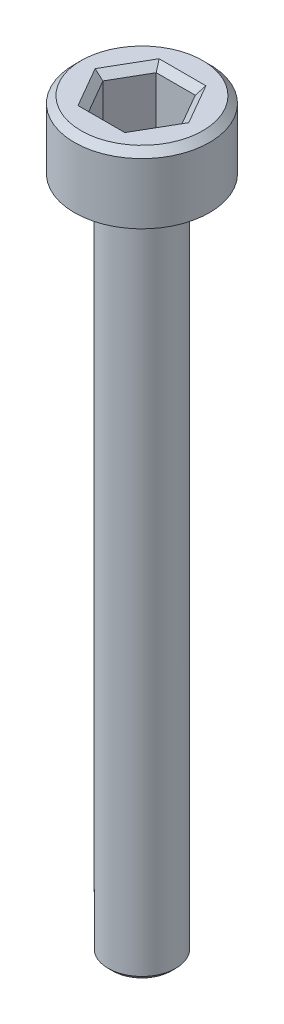
ISO-10303-21;
HEADER;
FILE_DESCRIPTION(('STEP AP214'),'2;1');
FILE_NAME('part.step','',(''),(''),'','','');
FILE_SCHEMA(('AUTOMOTIVE_DESIGN { 1 0 10303 214 1 1 1 1 }'));
ENDSEC;
DATA;
#1=APPLICATION_CONTEXT('core data for automotive mechanical design processes');
#2=APPLICATION_PROTOCOL_DEFINITION('international standard','automotive_design',2000,#1);
#3=PRODUCT_CONTEXT('',#1,'mechanical');
#4=PRODUCT('Part','Part','',(#3));
#5=PRODUCT_RELATED_PRODUCT_CATEGORY('part','',(#4));
#6=PRODUCT_DEFINITION_FORMATION('','',#4);
#7=PRODUCT_DEFINITION_CONTEXT('part definition',#1,'design');
#8=PRODUCT_DEFINITION('design','',#6,#7);
#9=PRODUCT_DEFINITION_SHAPE('','',#8);
#10=(LENGTH_UNIT() NAMED_UNIT(*) SI_UNIT(.MILLI.,.METRE.));
#11=(NAMED_UNIT(*) PLANE_ANGLE_UNIT() SI_UNIT($,.RADIAN.));
#12=(NAMED_UNIT(*) SI_UNIT($,.STERADIAN.) SOLID_ANGLE_UNIT());
#13=UNCERTAINTY_MEASURE_WITH_UNIT(LENGTH_MEASURE(1.E-05),#10,'distance_accuracy_value','');
#14=(GEOMETRIC_REPRESENTATION_CONTEXT(3) GLOBAL_UNCERTAINTY_ASSIGNED_CONTEXT((#13)) GLOBAL_UNIT_ASSIGNED_CONTEXT((#10,
#11,#12)) REPRESENTATION_CONTEXT('',''));
#15=CARTESIAN_POINT('',(0.,0.,0.));
#16=DIRECTION('',(0.,0.,1.));
#17=DIRECTION('',(1.,0.,0.));
#18=AXIS2_PLACEMENT_3D('',#15,#16,#17);
#19=CARTESIAN_POINT('',(0.,0.,0.));
#20=DIRECTION('',(0.,1.,0.));
#21=DIRECTION('',(0.,0.,1.));
#22=AXIS2_PLACEMENT_3D('',#19,#20,#21);
#23=PLANE('',#22);
#24=CARTESIAN_POINT('',(0.,0.,0.));
#25=DIRECTION('',(0.,1.,0.));
#26=DIRECTION('',(0.,0.,1.));
#27=AXIS2_PLACEMENT_3D('',#24,#25,#26);
#28=CIRCLE('',#27,3.);
#29=CARTESIAN_POINT('',(0.,0.,3.));
#30=VERTEX_POINT('',#29);
#31=EDGE_CURVE('E146',#30,#30,#28,.T.);
#32=ORIENTED_EDGE('',*,*,#31,.F.);
#33=EDGE_LOOP('',(#32));
#34=FACE_BOUND('',#33,.T.);
#35=CARTESIAN_POINT('',(0.,0.,0.));
#36=DIRECTION('',(0.,1.,0.));
#37=DIRECTION('',(0.,0.,1.));
#38=AXIS2_PLACEMENT_3D('',#35,#36,#37);
#39=CIRCLE('',#38,1.5);
#40=CARTESIAN_POINT('',(0.,0.,1.5));
#41=VERTEX_POINT('',#40);
#42=EDGE_CURVE('E185',#41,#41,#39,.F.);
#43=ORIENTED_EDGE('',*,*,#42,.F.);
#44=EDGE_LOOP('',(#43));
#45=FACE_BOUND('',#44,.T.);
#46=ADVANCED_FACE('F33',(#34,#45),#23,.F.);
#47=CARTESIAN_POINT('',(0.,3.,0.));
#48=DIRECTION('',(0.,-1.,0.));
#49=DIRECTION('',(0.,0.,-1.));
#50=AXIS2_PLACEMENT_3D('',#47,#48,#49);
#51=CYLINDRICAL_SURFACE('',#50,3.);
#52=CARTESIAN_POINT('',(0.,2.7,0.));
#53=DIRECTION('',(0.,1.,0.));
#54=DIRECTION('',(0.,0.,1.));
#55=AXIS2_PLACEMENT_3D('',#52,#53,#54);
#56=CIRCLE('',#55,3.);
#57=CARTESIAN_POINT('',(0.,2.7,3.));
#58=VERTEX_POINT('',#57);
#59=EDGE_CURVE('E160',#58,#58,#56,.F.);
#60=ORIENTED_EDGE('',*,*,#59,.T.);
#61=EDGE_LOOP('',(#60));
#62=FACE_BOUND('',#61,.T.);
#63=ORIENTED_EDGE('',*,*,#31,.T.);
#64=EDGE_LOOP('',(#63));
#65=FACE_BOUND('',#64,.T.);
#66=ADVANCED_FACE('F213',(#62,#65),#51,.T.);
#67=CARTESIAN_POINT('',(0.,3.,0.));
#68=DIRECTION('',(0.,1.,0.));
#69=DIRECTION('',(0.,0.,1.));
#70=AXIS2_PLACEMENT_3D('',#67,#68,#69);
#71=PLANE('',#70);
#72=DIRECTION('',(1.,0.,0.));
#73=VECTOR('',#72,1.);
#74=CARTESIAN_POINT('',(0.866025403784439,3.,-1.8));
#75=LINE('',#74,#73);
#76=CARTESIAN_POINT('',(-1.03923048454133,3.,-1.8));
#77=VERTEX_POINT('',#76);
#78=CARTESIAN_POINT('',(1.03923048454133,3.,-1.8));
#79=VERTEX_POINT('',#78);
#80=EDGE_CURVE('E165',#77,#79,#75,.T.);
#81=ORIENTED_EDGE('',*,*,#80,.T.);
#82=DIRECTION('',(0.5,0.,0.866025403784439));
#83=VECTOR('',#82,1.);
#84=CARTESIAN_POINT('',(1.99185842870421,3.,-0.150000000000001));
#85=LINE('',#84,#83);
#86=CARTESIAN_POINT('',(2.07846096908265,3.,0.));
#87=VERTEX_POINT('',#86);
#88=EDGE_CURVE('E175',#79,#87,#85,.T.);
#89=ORIENTED_EDGE('',*,*,#88,.T.);
#90=DIRECTION('',(-0.5,0.,0.866025403784439));
#91=VECTOR('',#90,1.);
#92=CARTESIAN_POINT('',(1.12583302491977,3.,1.65));
#93=LINE('',#92,#91);
#94=CARTESIAN_POINT('',(1.03923048454133,3.,1.8));
#95=VERTEX_POINT('',#94);
#96=EDGE_CURVE('E173',#87,#95,#93,.T.);
#97=ORIENTED_EDGE('',*,*,#96,.T.);
#98=DIRECTION('',(-1.,0.,0.));
#99=VECTOR('',#98,1.);
#100=CARTESIAN_POINT('',(-0.866025403784438,3.,1.8));
#101=LINE('',#100,#99);
#102=CARTESIAN_POINT('',(-1.03923048454133,3.,1.8));
#103=VERTEX_POINT('',#102);
#104=EDGE_CURVE('E171',#95,#103,#101,.T.);
#105=ORIENTED_EDGE('',*,*,#104,.T.);
#106=DIRECTION('',(-0.5,0.,-0.866025403784439));
#107=VECTOR('',#106,1.);
#108=CARTESIAN_POINT('',(-1.99185842870421,3.,0.150000000000001));
#109=LINE('',#108,#107);
#110=CARTESIAN_POINT('',(-2.07846096908265,3.,0.));
#111=VERTEX_POINT('',#110);
#112=EDGE_CURVE('E169',#103,#111,#109,.T.);
#113=ORIENTED_EDGE('',*,*,#112,.T.);
#114=DIRECTION('',(0.5,0.,-0.866025403784439));
#115=VECTOR('',#114,1.);
#116=CARTESIAN_POINT('',(-1.12583302491977,3.,-1.65));
#117=LINE('',#116,#115);
#118=EDGE_CURVE('E167',#111,#77,#117,.T.);
#119=ORIENTED_EDGE('',*,*,#118,.T.);
#120=EDGE_LOOP('',(#81,#89,#97,#105,#113,#119));
#121=FACE_BOUND('',#120,.T.);
#122=CARTESIAN_POINT('',(0.,3.,0.));
#123=DIRECTION('',(0.,1.,0.));
#124=DIRECTION('',(0.,0.,1.));
#125=AXIS2_PLACEMENT_3D('',#122,#123,#124);
#126=CIRCLE('',#125,2.7);
#127=CARTESIAN_POINT('',(0.,3.,2.7));
#128=VERTEX_POINT('',#127);
#129=EDGE_CURVE('E157',#128,#128,#126,.T.);
#130=ORIENTED_EDGE('',*,*,#129,.T.);
#131=EDGE_LOOP('',(#130));
#132=FACE_BOUND('',#131,.T.);
#133=ADVANCED_FACE('F219',(#121,#132),#71,.T.);
#134=CARTESIAN_POINT('',(0.,3.,0.));
#135=DIRECTION('',(0.,-1.,0.));
#136=DIRECTION('',(0.,0.,-1.));
#137=AXIS2_PLACEMENT_3D('',#134,#135,#136);
#138=CONICAL_SURFACE('',#137,2.7,0.785398163397448);
#139=ORIENTED_EDGE('',*,*,#59,.F.);
#140=EDGE_LOOP('',(#139));
#141=FACE_BOUND('',#140,.T.);
#142=ORIENTED_EDGE('',*,*,#129,.F.);
#143=EDGE_LOOP('',(#142));
#144=FACE_BOUND('',#143,.T.);
#145=ADVANCED_FACE('F227',(#141,#144),#138,.T.);
#146=CARTESIAN_POINT('',(0.866025403784439,0.5,1.5));
#147=DIRECTION('',(0.866025403784439,0.,0.5));
#148=DIRECTION('',(0.5,0.,-0.866025403784439));
#149=AXIS2_PLACEMENT_3D('',#146,#147,#148);
#150=PLANE('',#149);
#151=DIRECTION('',(0.,1.,0.));
#152=VECTOR('',#151,1.);
#153=CARTESIAN_POINT('',(0.866025403784439,0.5,1.5));
#154=LINE('',#153,#152);
#155=CARTESIAN_POINT('',(0.866025403784439,0.5,1.5));
#156=VERTEX_POINT('',#155);
#157=CARTESIAN_POINT('',(0.866025403784439,2.7,1.5));
#158=VERTEX_POINT('',#157);
#159=EDGE_CURVE('E144',#156,#158,#154,.T.);
#160=ORIENTED_EDGE('',*,*,#159,.T.);
#161=DIRECTION('',(0.5,0.,-0.866025403784439));
#162=VECTOR('',#161,1.);
#163=CARTESIAN_POINT('',(1.73205080756888,2.7,0.));
#164=LINE('',#163,#162);
#165=CARTESIAN_POINT('',(1.73205080756888,2.7,0.));
#166=VERTEX_POINT('',#165);
#167=EDGE_CURVE('E113',#158,#166,#164,.T.);
#168=ORIENTED_EDGE('',*,*,#167,.T.);
#169=DIRECTION('',(0.,1.,0.));
#170=VECTOR('',#169,1.);
#171=CARTESIAN_POINT('',(1.73205080756888,0.5,0.));
#172=LINE('',#171,#170);
#173=CARTESIAN_POINT('',(1.73205080756888,0.5,0.));
#174=VERTEX_POINT('',#173);
#175=EDGE_CURVE('E105',#174,#166,#172,.T.);
#176=ORIENTED_EDGE('',*,*,#175,.F.);
#177=DIRECTION('',(0.5,0.,-0.866025403784439));
#178=VECTOR('',#177,1.);
#179=CARTESIAN_POINT('',(0.866025403784439,0.5,1.5));
#180=LINE('',#179,#178);
#181=EDGE_CURVE('E110',#156,#174,#180,.T.);
#182=ORIENTED_EDGE('',*,*,#181,.F.);
#183=EDGE_LOOP('',(#160,#168,#176,#182));
#184=FACE_BOUND('',#183,.T.);
#185=ADVANCED_FACE('F108',(#184),#150,.F.);
#186=CARTESIAN_POINT('',(-0.866025403784438,0.5,1.5));
#187=DIRECTION('',(0.,0.,1.));
#188=DIRECTION('',(1.,0.,0.));
#189=AXIS2_PLACEMENT_3D('',#186,#187,#188);
#190=PLANE('',#189);
#191=DIRECTION('',(0.,1.,0.));
#192=VECTOR('',#191,1.);
#193=CARTESIAN_POINT('',(-0.866025403784438,0.5,1.5));
#194=LINE('',#193,#192);
#195=CARTESIAN_POINT('',(-0.866025403784438,0.5,1.5));
#196=VERTEX_POINT('',#195);
#197=CARTESIAN_POINT('',(-0.866025403784438,2.7,1.5));
#198=VERTEX_POINT('',#197);
#199=EDGE_CURVE('E147',#196,#198,#194,.T.);
#200=ORIENTED_EDGE('',*,*,#199,.T.);
#201=DIRECTION('',(1.,0.,0.));
#202=VECTOR('',#201,1.);
#203=CARTESIAN_POINT('',(0.866025403784439,2.7,1.5));
#204=LINE('',#203,#202);
#205=EDGE_CURVE('E179',#198,#158,#204,.T.);
#206=ORIENTED_EDGE('',*,*,#205,.T.);
#207=ORIENTED_EDGE('',*,*,#159,.F.);
#208=DIRECTION('',(1.,0.,0.));
#209=VECTOR('',#208,1.);
#210=CARTESIAN_POINT('',(-0.866025403784438,0.5,1.5));
#211=LINE('',#210,#209);
#212=EDGE_CURVE('E118',#196,#156,#211,.T.);
#213=ORIENTED_EDGE('',*,*,#212,.F.);
#214=EDGE_LOOP('',(#200,#206,#207,#213));
#215=FACE_BOUND('',#214,.T.);
#216=ADVANCED_FACE('F280',(#215),#190,.F.);
#217=CARTESIAN_POINT('',(-1.73205080756888,0.5,0.));
#218=DIRECTION('',(-0.866025403784438,0.,0.5));
#219=DIRECTION('',(0.5,0.,0.866025403784439));
#220=AXIS2_PLACEMENT_3D('',#217,#218,#219);
#221=PLANE('',#220);
#222=DIRECTION('',(0.,1.,0.));
#223=VECTOR('',#222,1.);
#224=CARTESIAN_POINT('',(-1.73205080756888,0.5,0.));
#225=LINE('',#224,#223);
#226=CARTESIAN_POINT('',(-1.73205080756888,0.5,0.));
#227=VERTEX_POINT('',#226);
#228=CARTESIAN_POINT('',(-1.73205080756888,2.7,0.));
#229=VERTEX_POINT('',#228);
#230=EDGE_CURVE('E150',#227,#229,#225,.T.);
#231=ORIENTED_EDGE('',*,*,#230,.T.);
#232=DIRECTION('',(0.5,0.,0.866025403784439));
#233=VECTOR('',#232,1.);
#234=CARTESIAN_POINT('',(-0.866025403784438,2.7,1.5));
#235=LINE('',#234,#233);
#236=EDGE_CURVE('E181',#229,#198,#235,.T.);
#237=ORIENTED_EDGE('',*,*,#236,.T.);
#238=ORIENTED_EDGE('',*,*,#199,.F.);
#239=DIRECTION('',(0.5,0.,0.866025403784439));
#240=VECTOR('',#239,1.);
#241=CARTESIAN_POINT('',(-1.73205080756888,0.5,0.));
#242=LINE('',#241,#240);
#243=EDGE_CURVE('E141',#227,#196,#242,.T.);
#244=ORIENTED_EDGE('',*,*,#243,.F.);
#245=EDGE_LOOP('',(#231,#237,#238,#244));
#246=FACE_BOUND('',#245,.T.);
#247=ADVANCED_FACE('F278',(#246),#221,.F.);
#248=CARTESIAN_POINT('',(-0.866025403784438,0.5,-1.5));
#249=DIRECTION('',(-0.866025403784439,0.,-0.5));
#250=DIRECTION('',(-0.5,0.,0.866025403784439));
#251=AXIS2_PLACEMENT_3D('',#248,#249,#250);
#252=PLANE('',#251);
#253=DIRECTION('',(0.,1.,0.));
#254=VECTOR('',#253,1.);
#255=CARTESIAN_POINT('',(-0.866025403784438,0.5,-1.5));
#256=LINE('',#255,#254);
#257=CARTESIAN_POINT('',(-0.866025403784438,0.5,-1.5));
#258=VERTEX_POINT('',#257);
#259=CARTESIAN_POINT('',(-0.866025403784438,2.7,-1.5));
#260=VERTEX_POINT('',#259);
#261=EDGE_CURVE('E152',#258,#260,#256,.T.);
#262=ORIENTED_EDGE('',*,*,#261,.T.);
#263=DIRECTION('',(-0.5,0.,0.866025403784439));
#264=VECTOR('',#263,1.);
#265=CARTESIAN_POINT('',(-1.73205080756888,2.7,0.));
#266=LINE('',#265,#264);
#267=EDGE_CURVE('E55',#260,#229,#266,.T.);
#268=ORIENTED_EDGE('',*,*,#267,.T.);
#269=ORIENTED_EDGE('',*,*,#230,.F.);
#270=DIRECTION('',(-0.5,0.,0.866025403784439));
#271=VECTOR('',#270,1.);
#272=CARTESIAN_POINT('',(-0.866025403784438,0.5,-1.5));
#273=LINE('',#272,#271);
#274=EDGE_CURVE('E138',#258,#227,#273,.T.);
#275=ORIENTED_EDGE('',*,*,#274,.F.);
#276=EDGE_LOOP('',(#262,#268,#269,#275));
#277=FACE_BOUND('',#276,.T.);
#278=ADVANCED_FACE('F276',(#277),#252,.F.);
#279=CARTESIAN_POINT('',(0.866025403784439,0.5,-1.5));
#280=DIRECTION('',(0.,0.,-1.));
#281=DIRECTION('',(-1.,0.,0.));
#282=AXIS2_PLACEMENT_3D('',#279,#280,#281);
#283=PLANE('',#282);
#284=DIRECTION('',(0.,1.,0.));
#285=VECTOR('',#284,1.);
#286=CARTESIAN_POINT('',(0.866025403784439,0.5,-1.5));
#287=LINE('',#286,#285);
#288=CARTESIAN_POINT('',(0.866025403784439,0.5,-1.5));
#289=VERTEX_POINT('',#288);
#290=CARTESIAN_POINT('',(0.866025403784439,2.7,-1.5));
#291=VERTEX_POINT('',#290);
#292=EDGE_CURVE('E117',#289,#291,#287,.T.);
#293=ORIENTED_EDGE('',*,*,#292,.T.);
#294=DIRECTION('',(-1.,0.,0.));
#295=VECTOR('',#294,1.);
#296=CARTESIAN_POINT('',(-0.866025403784438,2.7,-1.5));
#297=LINE('',#296,#295);
#298=EDGE_CURVE('E48',#291,#260,#297,.T.);
#299=ORIENTED_EDGE('',*,*,#298,.T.);
#300=ORIENTED_EDGE('',*,*,#261,.F.);
#301=DIRECTION('',(-1.,0.,0.));
#302=VECTOR('',#301,1.);
#303=CARTESIAN_POINT('',(0.866025403784439,0.5,-1.5));
#304=LINE('',#303,#302);
#305=EDGE_CURVE('E126',#289,#258,#304,.T.);
#306=ORIENTED_EDGE('',*,*,#305,.F.);
#307=EDGE_LOOP('',(#293,#299,#300,#306));
#308=FACE_BOUND('',#307,.T.);
#309=ADVANCED_FACE('F273',(#308),#283,.F.);
#310=CARTESIAN_POINT('',(1.73205080756888,0.5,0.));
#311=DIRECTION('',(0.866025403784438,0.,-0.5));
#312=DIRECTION('',(-0.5,0.,-0.866025403784438));
#313=AXIS2_PLACEMENT_3D('',#310,#311,#312);
#314=PLANE('',#313);
#315=ORIENTED_EDGE('',*,*,#175,.T.);
#316=DIRECTION('',(-0.5,0.,-0.866025403784438));
#317=VECTOR('',#316,1.);
#318=CARTESIAN_POINT('',(0.866025403784439,2.7,-1.5));
#319=LINE('',#318,#317);
#320=EDGE_CURVE('E163',#166,#291,#319,.T.);
#321=ORIENTED_EDGE('',*,*,#320,.T.);
#322=ORIENTED_EDGE('',*,*,#292,.F.);
#323=DIRECTION('',(-0.5,0.,-0.866025403784438));
#324=VECTOR('',#323,1.);
#325=CARTESIAN_POINT('',(1.73205080756888,0.5,0.));
#326=LINE('',#325,#324);
#327=EDGE_CURVE('E121',#174,#289,#326,.T.);
#328=ORIENTED_EDGE('',*,*,#327,.F.);
#329=EDGE_LOOP('',(#315,#321,#322,#328));
#330=FACE_BOUND('',#329,.T.);
#331=ADVANCED_FACE('F122',(#330),#314,.F.);
#332=CARTESIAN_POINT('',(0.,0.5,0.));
#333=DIRECTION('',(0.,1.,0.));
#334=DIRECTION('',(0.,0.,1.));
#335=AXIS2_PLACEMENT_3D('',#332,#333,#334);
#336=PLANE('',#335);
#337=ORIENTED_EDGE('',*,*,#181,.T.);
#338=ORIENTED_EDGE('',*,*,#327,.T.);
#339=ORIENTED_EDGE('',*,*,#305,.T.);
#340=ORIENTED_EDGE('',*,*,#274,.T.);
#341=ORIENTED_EDGE('',*,*,#243,.T.);
#342=ORIENTED_EDGE('',*,*,#212,.T.);
#343=EDGE_LOOP('',(#337,#338,#339,#340,#341,#342));
#344=FACE_BOUND('',#343,.T.);
#345=ADVANCED_FACE('F128',(#344),#336,.T.);
#346=CARTESIAN_POINT('',(-1.73205080756888,2.7,0.));
#347=DIRECTION('',(0.612372435695794,0.707106781186548,-0.353553390593273));
#348=DIRECTION('',(-0.5,0.,-0.866025403784439));
#349=AXIS2_PLACEMENT_3D('',#346,#347,#348);
#350=PLANE('',#349);
#351=DIRECTION('',(0.755928946018455,-0.654653670707976,0.));
#352=VECTOR('',#351,1.);
#353=CARTESIAN_POINT('',(-1.73205080756888,2.7,0.));
#354=LINE('',#353,#352);
#355=EDGE_CURVE('E134',#111,#229,#354,.T.);
#356=ORIENTED_EDGE('',*,*,#355,.F.);
#357=ORIENTED_EDGE('',*,*,#112,.F.);
#358=DIRECTION('',(0.377964473009228,-0.654653670707976,-0.654653670707978));
#359=VECTOR('',#358,1.);
#360=CARTESIAN_POINT('',(-0.866025403784438,2.7,1.5));
#361=LINE('',#360,#359);
#362=EDGE_CURVE('E131',#198,#103,#361,.F.);
#363=ORIENTED_EDGE('',*,*,#362,.F.);
#364=ORIENTED_EDGE('',*,*,#236,.F.);
#365=EDGE_LOOP('',(#356,#357,#363,#364));
#366=FACE_BOUND('',#365,.T.);
#367=ADVANCED_FACE('F249',(#366),#350,.T.);
#368=CARTESIAN_POINT('',(-0.866025403784438,2.7,1.5));
#369=DIRECTION('',(0.,0.707106781186548,-0.707106781186547));
#370=DIRECTION('',(-1.,0.,0.));
#371=AXIS2_PLACEMENT_3D('',#368,#369,#370);
#372=PLANE('',#371);
#373=ORIENTED_EDGE('',*,*,#362,.T.);
#374=ORIENTED_EDGE('',*,*,#104,.F.);
#375=DIRECTION('',(-0.377964473009228,-0.654653670707976,-0.654653670707978));
#376=VECTOR('',#375,1.);
#377=CARTESIAN_POINT('',(0.866025403784439,2.7,1.5));
#378=LINE('',#377,#376);
#379=EDGE_CURVE('E193',#158,#95,#378,.F.);
#380=ORIENTED_EDGE('',*,*,#379,.F.);
#381=ORIENTED_EDGE('',*,*,#205,.F.);
#382=EDGE_LOOP('',(#373,#374,#380,#381));
#383=FACE_BOUND('',#382,.T.);
#384=ADVANCED_FACE('F246',(#383),#372,.T.);
#385=CARTESIAN_POINT('',(-0.866025403784438,2.7,-1.5));
#386=DIRECTION('',(0.612372435695794,0.707106781186549,0.353553390593273));
#387=DIRECTION('',(0.5,0.,-0.866025403784439));
#388=AXIS2_PLACEMENT_3D('',#385,#386,#387);
#389=PLANE('',#388);
#390=ORIENTED_EDGE('',*,*,#355,.T.);
#391=ORIENTED_EDGE('',*,*,#267,.F.);
#392=DIRECTION('',(0.377964473009228,-0.654653670707976,0.654653670707978));
#393=VECTOR('',#392,1.);
#394=CARTESIAN_POINT('',(-0.866025403784438,2.7,-1.5));
#395=LINE('',#394,#393);
#396=EDGE_CURVE('E190',#77,#260,#395,.T.);
#397=ORIENTED_EDGE('',*,*,#396,.F.);
#398=ORIENTED_EDGE('',*,*,#118,.F.);
#399=EDGE_LOOP('',(#390,#391,#397,#398));
#400=FACE_BOUND('',#399,.T.);
#401=ADVANCED_FACE('F242',(#400),#389,.T.);
#402=CARTESIAN_POINT('',(0.866025403784439,2.7,1.5));
#403=DIRECTION('',(-0.612372435695794,0.707106781186549,-0.353553390593273));
#404=DIRECTION('',(-0.5,0.,0.866025403784439));
#405=AXIS2_PLACEMENT_3D('',#402,#403,#404);
#406=PLANE('',#405);
#407=ORIENTED_EDGE('',*,*,#379,.T.);
#408=ORIENTED_EDGE('',*,*,#96,.F.);
#409=DIRECTION('',(-0.755928946018455,-0.654653670707976,0.));
#410=VECTOR('',#409,1.);
#411=CARTESIAN_POINT('',(1.73205080756888,2.7,0.));
#412=LINE('',#411,#410);
#413=EDGE_CURVE('E188',#166,#87,#412,.F.);
#414=ORIENTED_EDGE('',*,*,#413,.F.);
#415=ORIENTED_EDGE('',*,*,#167,.F.);
#416=EDGE_LOOP('',(#407,#408,#414,#415));
#417=FACE_BOUND('',#416,.T.);
#418=ADVANCED_FACE('F238',(#417),#406,.T.);
#419=CARTESIAN_POINT('',(0.866025403784439,2.7,-1.5));
#420=DIRECTION('',(0.,0.707106781186549,0.707106781186547));
#421=DIRECTION('',(1.,0.,0.));
#422=AXIS2_PLACEMENT_3D('',#419,#420,#421);
#423=PLANE('',#422);
#424=ORIENTED_EDGE('',*,*,#396,.T.);
#425=ORIENTED_EDGE('',*,*,#298,.F.);
#426=DIRECTION('',(0.377964473009228,0.654653670707976,-0.654653670707978));
#427=VECTOR('',#426,1.);
#428=CARTESIAN_POINT('',(0.618589574131741,2.27142857142857,-1.07142857142857));
#429=LINE('',#428,#427);
#430=EDGE_CURVE('E186',#79,#291,#429,.F.);
#431=ORIENTED_EDGE('',*,*,#430,.F.);
#432=ORIENTED_EDGE('',*,*,#80,.F.);
#433=EDGE_LOOP('',(#424,#425,#431,#432));
#434=FACE_BOUND('',#433,.T.);
#435=ADVANCED_FACE('F234',(#434),#423,.T.);
#436=CARTESIAN_POINT('',(1.73205080756888,2.7,0.));
#437=DIRECTION('',(-0.612372435695793,0.707106781186549,0.353553390593273));
#438=DIRECTION('',(0.5,0.,0.866025403784438));
#439=AXIS2_PLACEMENT_3D('',#436,#437,#438);
#440=PLANE('',#439);
#441=ORIENTED_EDGE('',*,*,#413,.T.);
#442=ORIENTED_EDGE('',*,*,#88,.F.);
#443=ORIENTED_EDGE('',*,*,#430,.T.);
#444=ORIENTED_EDGE('',*,*,#320,.F.);
#445=EDGE_LOOP('',(#441,#442,#443,#444));
#446=FACE_BOUND('',#445,.T.);
#447=ADVANCED_FACE('F231',(#446),#440,.T.);
#448=CARTESIAN_POINT('',(0.,-30.,0.));
#449=DIRECTION('',(0.,1.,0.));
#450=DIRECTION('',(0.,0.,1.));
#451=AXIS2_PLACEMENT_3D('',#448,#449,#450);
#452=CYLINDRICAL_SURFACE('',#451,1.5);
#453=CARTESIAN_POINT('',(0.,-29.8,0.));
#454=DIRECTION('',(0.,-1.,0.));
#455=DIRECTION('',(0.,0.,-1.));
#456=AXIS2_PLACEMENT_3D('',#453,#454,#455);
#457=CIRCLE('',#456,1.5);
#458=CARTESIAN_POINT('',(0.,-29.8,-1.5));
#459=VERTEX_POINT('',#458);
#460=EDGE_CURVE('E11',#459,#459,#457,.F.);
#461=ORIENTED_EDGE('',*,*,#460,.T.);
#462=EDGE_LOOP('',(#461));
#463=FACE_BOUND('',#462,.T.);
#464=ORIENTED_EDGE('',*,*,#42,.T.);
#465=EDGE_LOOP('',(#464));
#466=FACE_BOUND('',#465,.T.);
#467=ADVANCED_FACE('F209',(#463,#466),#452,.T.);
#468=CARTESIAN_POINT('',(0.,-30.,0.));
#469=DIRECTION('',(0.,-1.,0.));
#470=DIRECTION('',(0.,0.,-1.));
#471=AXIS2_PLACEMENT_3D('',#468,#469,#470);
#472=PLANE('',#471);
#473=CARTESIAN_POINT('',(0.,-30.,0.));
#474=DIRECTION('',(0.,-1.,0.));
#475=DIRECTION('',(0.,0.,-1.));
#476=AXIS2_PLACEMENT_3D('',#473,#474,#475);
#477=CIRCLE('',#476,1.3);
#478=CARTESIAN_POINT('',(0.,-30.,-1.3));
#479=VERTEX_POINT('',#478);
#480=EDGE_CURVE('E41',#479,#479,#477,.T.);
#481=ORIENTED_EDGE('',*,*,#480,.T.);
#482=EDGE_LOOP('',(#481));
#483=FACE_BOUND('',#482,.T.);
#484=ADVANCED_FACE('F202',(#483),#472,.T.);
#485=CARTESIAN_POINT('',(0.,-30.,0.));
#486=DIRECTION('',(0.,1.,0.));
#487=DIRECTION('',(0.,0.,1.));
#488=AXIS2_PLACEMENT_3D('',#485,#486,#487);
#489=CONICAL_SURFACE('',#488,1.3,0.785398163397437);
#490=ORIENTED_EDGE('',*,*,#460,.F.);
#491=EDGE_LOOP('',(#490));
#492=FACE_BOUND('',#491,.T.);
#493=ORIENTED_EDGE('',*,*,#480,.F.);
#494=EDGE_LOOP('',(#493));
#495=FACE_BOUND('',#494,.T.);
#496=ADVANCED_FACE('F35',(#492,#495),#489,.T.);
#497=CLOSED_SHELL('',(#46,#66,#133,#145,#185,#216,#247,#278,#309,#331,#345,#367,#384,#401,#418,
#435,#447,#467,#484,#496));
#498=MANIFOLD_SOLID_BREP('B2',#497);
#499=ADVANCED_BREP_SHAPE_REPRESENTATION('',(#18,#498),#14);
#500=SHAPE_DEFINITION_REPRESENTATION(#9,#499);
ENDSEC;
END-ISO-10303-21;
